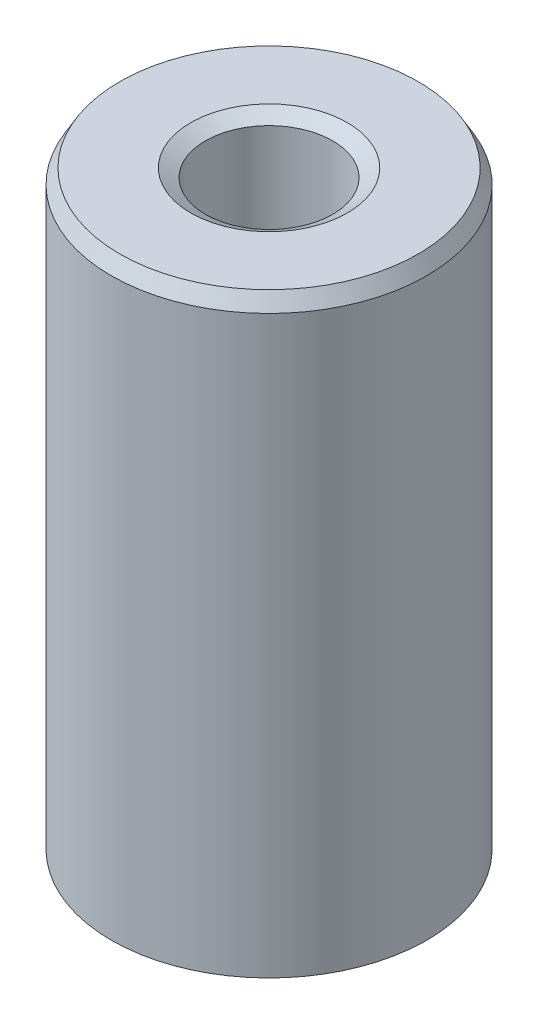
ISO-10303-21;
HEADER;
FILE_DESCRIPTION(('STEP AP214'),'2;1');
FILE_NAME('part.step','',(''),(''),'','','');
FILE_SCHEMA(('AUTOMOTIVE_DESIGN { 1 0 10303 214 1 1 1 1 }'));
ENDSEC;
DATA;
#1=APPLICATION_CONTEXT('core data for automotive mechanical design processes');
#2=APPLICATION_PROTOCOL_DEFINITION('international standard','automotive_design',2000,#1);
#3=PRODUCT_CONTEXT('',#1,'mechanical');
#4=PRODUCT('Part','Part','',(#3));
#5=PRODUCT_RELATED_PRODUCT_CATEGORY('part','',(#4));
#6=PRODUCT_DEFINITION_FORMATION('','',#4);
#7=PRODUCT_DEFINITION_CONTEXT('part definition',#1,'design');
#8=PRODUCT_DEFINITION('design','',#6,#7);
#9=PRODUCT_DEFINITION_SHAPE('','',#8);
#10=(LENGTH_UNIT() NAMED_UNIT(*) SI_UNIT(.MILLI.,.METRE.));
#11=(NAMED_UNIT(*) PLANE_ANGLE_UNIT() SI_UNIT($,.RADIAN.));
#12=(NAMED_UNIT(*) SI_UNIT($,.STERADIAN.) SOLID_ANGLE_UNIT());
#13=UNCERTAINTY_MEASURE_WITH_UNIT(LENGTH_MEASURE(1.E-05),#10,'distance_accuracy_value','');
#14=(GEOMETRIC_REPRESENTATION_CONTEXT(3) GLOBAL_UNCERTAINTY_ASSIGNED_CONTEXT((#13)) GLOBAL_UNIT_ASSIGNED_CONTEXT((#10,
#11,#12)) REPRESENTATION_CONTEXT('',''));
#15=CARTESIAN_POINT('',(0.,0.,0.));
#16=DIRECTION('',(0.,0.,1.));
#17=DIRECTION('',(1.,0.,0.));
#18=AXIS2_PLACEMENT_3D('',#15,#16,#17);
#19=CARTESIAN_POINT('',(0.,132.829947663581,0.));
#20=DIRECTION('',(0.,-1.,0.));
#21=DIRECTION('',(0.,0.,-1.));
#22=AXIS2_PLACEMENT_3D('',#19,#20,#21);
#23=CYLINDRICAL_SURFACE('',#22,35.);
#24=CARTESIAN_POINT('',(0.,1.87428707114171,0.));
#25=DIRECTION('',(0.,1.,0.));
#26=DIRECTION('',(0.,0.,1.));
#27=AXIS2_PLACEMENT_3D('',#24,#25,#26);
#28=CIRCLE('',#27,35.);
#29=CARTESIAN_POINT('',(0.,1.87428707114171,35.));
#30=VERTEX_POINT('',#29);
#31=EDGE_CURVE('E10',#30,#30,#28,.T.);
#32=ORIENTED_EDGE('',*,*,#31,.T.);
#33=EDGE_LOOP('',(#32));
#34=FACE_BOUND('',#33,.T.);
#35=CARTESIAN_POINT('',(0.,129.583587228394,0.));
#36=DIRECTION('',(0.,1.,0.));
#37=DIRECTION('',(0.,0.,1.));
#38=AXIS2_PLACEMENT_3D('',#35,#36,#37);
#39=CIRCLE('',#38,35.);
#40=CARTESIAN_POINT('',(0.,129.583587228394,35.));
#41=VERTEX_POINT('',#40);
#42=EDGE_CURVE('E50',#41,#41,#39,.F.);
#43=ORIENTED_EDGE('',*,*,#42,.T.);
#44=EDGE_LOOP('',(#43));
#45=FACE_BOUND('',#44,.T.);
#46=ADVANCED_FACE('F39',(#34,#45),#23,.T.);
#47=CARTESIAN_POINT('',(0.,132.829947663581,0.));
#48=DIRECTION('',(0.,1.,0.));
#49=DIRECTION('',(0.,0.,1.));
#50=AXIS2_PLACEMENT_3D('',#47,#48,#49);
#51=PLANE('',#50);
#52=CARTESIAN_POINT('',(0.,132.829947663581,0.));
#53=DIRECTION('',(0.,1.,0.));
#54=DIRECTION('',(0.,0.,1.));
#55=AXIS2_PLACEMENT_3D('',#52,#53,#54);
#56=CIRCLE('',#55,17.3772116874196);
#57=CARTESIAN_POINT('',(0.,132.829947663581,17.3772116874196));
#58=VERTEX_POINT('',#57);
#59=EDGE_CURVE('E58',#58,#58,#56,.F.);
#60=ORIENTED_EDGE('',*,*,#59,.T.);
#61=EDGE_LOOP('',(#60));
#62=FACE_BOUND('',#61,.T.);
#63=CARTESIAN_POINT('',(0.,132.829947663581,0.));
#64=DIRECTION('',(0.,1.,0.));
#65=DIRECTION('',(0.,0.,1.));
#66=AXIS2_PLACEMENT_3D('',#63,#64,#65);
#67=CIRCLE('',#66,33.1257129288583);
#68=CARTESIAN_POINT('',(0.,132.829947663581,33.1257129288583));
#69=VERTEX_POINT('',#68);
#70=EDGE_CURVE('E61',#69,#69,#67,.T.);
#71=ORIENTED_EDGE('',*,*,#70,.T.);
#72=EDGE_LOOP('',(#71));
#73=FACE_BOUND('',#72,.T.);
#74=ADVANCED_FACE('F88',(#62,#73),#51,.T.);
#75=CARTESIAN_POINT('',(0.,0.,0.));
#76=DIRECTION('',(0.,1.,0.));
#77=DIRECTION('',(0.,0.,1.));
#78=AXIS2_PLACEMENT_3D('',#75,#76,#77);
#79=PLANE('',#78);
#80=CARTESIAN_POINT('',(0.,0.,0.));
#81=DIRECTION('',(0.,1.,0.));
#82=DIRECTION('',(0.,0.,1.));
#83=AXIS2_PLACEMENT_3D('',#80,#81,#82);
#84=CIRCLE('',#83,16.0051383233744);
#85=CARTESIAN_POINT('',(0.,0.,16.0051383233744));
#86=VERTEX_POINT('',#85);
#87=EDGE_CURVE('E51',#86,#86,#84,.T.);
#88=ORIENTED_EDGE('',*,*,#87,.T.);
#89=EDGE_LOOP('',(#88));
#90=FACE_BOUND('',#89,.T.);
#91=CARTESIAN_POINT('',(0.,0.,0.));
#92=DIRECTION('',(0.,1.,0.));
#93=DIRECTION('',(0.,0.,1.));
#94=AXIS2_PLACEMENT_3D('',#91,#92,#93);
#95=CIRCLE('',#94,31.7536395648131);
#96=CARTESIAN_POINT('',(0.,0.,31.7536395648131));
#97=VERTEX_POINT('',#96);
#98=EDGE_CURVE('E54',#97,#97,#95,.F.);
#99=ORIENTED_EDGE('',*,*,#98,.T.);
#100=EDGE_LOOP('',(#99));
#101=FACE_BOUND('',#100,.T.);
#102=ADVANCED_FACE('F83',(#90,#101),#79,.F.);
#103=CARTESIAN_POINT('',(0.,132.829947663581,0.));
#104=DIRECTION('',(0.,-1.,0.));
#105=DIRECTION('',(0.,0.,-1.));
#106=AXIS2_PLACEMENT_3D('',#103,#104,#105);
#107=CYLINDRICAL_SURFACE('',#106,14.1308512522327);
#108=CARTESIAN_POINT('',(0.,130.955660592439,0.));
#109=DIRECTION('',(0.,1.,0.));
#110=DIRECTION('',(0.,0.,1.));
#111=AXIS2_PLACEMENT_3D('',#108,#109,#110);
#112=CIRCLE('',#111,14.1308512522327);
#113=CARTESIAN_POINT('',(0.,130.955660592439,14.1308512522326));
#114=VERTEX_POINT('',#113);
#115=EDGE_CURVE('E67',#114,#114,#112,.T.);
#116=ORIENTED_EDGE('',*,*,#115,.T.);
#117=EDGE_LOOP('',(#116));
#118=FACE_BOUND('',#117,.T.);
#119=CARTESIAN_POINT('',(0.,3.24636043518695,0.));
#120=DIRECTION('',(0.,1.,0.));
#121=DIRECTION('',(0.,0.,1.));
#122=AXIS2_PLACEMENT_3D('',#119,#120,#121);
#123=CIRCLE('',#122,14.1308512522327);
#124=CARTESIAN_POINT('',(0.,3.24636043518695,14.1308512522327));
#125=VERTEX_POINT('',#124);
#126=EDGE_CURVE('E69',#125,#125,#123,.F.);
#127=ORIENTED_EDGE('',*,*,#126,.T.);
#128=EDGE_LOOP('',(#127));
#129=FACE_BOUND('',#128,.T.);
#130=ADVANCED_FACE('F71',(#118,#129),#107,.F.);
#131=CARTESIAN_POINT('',(0.,130.955660592439,0.));
#132=DIRECTION('',(0.,1.,0.));
#133=DIRECTION('',(0.,0.,1.));
#134=AXIS2_PLACEMENT_3D('',#131,#132,#133);
#135=CONICAL_SURFACE('',#134,14.1308512522327,1.0471975511966);
#136=CARTESIAN_POINT('',(0.,132.829947663581,17.3772116874196));
#137=CARTESIAN_POINT('',(0.,132.810423839923,17.3433954328864));
#138=CARTESIAN_POINT('',(0.,132.790900016265,17.3095791783532));
#139=CARTESIAN_POINT('',(0.,132.75185236895,17.2419466692868));
#140=CARTESIAN_POINT('',(0.,132.732328545292,17.2081304147536));
#141=CARTESIAN_POINT('',(0.,132.693280897977,17.1404979056872));
#142=CARTESIAN_POINT('',(0.,132.673757074319,17.106681651154));
#143=CARTESIAN_POINT('',(0.,132.634709427004,17.0390491420876));
#144=CARTESIAN_POINT('',(0.,132.615185603346,17.0052328875544));
#145=CARTESIAN_POINT('',(0.,132.57613795603,16.937600378488));
#146=CARTESIAN_POINT('',(0.,132.556614132373,16.9037841239548));
#147=CARTESIAN_POINT('',(0.,132.517566485057,16.8361516148884));
#148=CARTESIAN_POINT('',(0.,132.498042661399,16.8023353603552));
#149=CARTESIAN_POINT('',(0.,132.458995014084,16.7347028512888));
#150=CARTESIAN_POINT('',(0.,132.439471190426,16.7008865967556));
#151=CARTESIAN_POINT('',(0.,132.400423543111,16.6332540876892));
#152=CARTESIAN_POINT('',(0.,132.380899719453,16.599437833156));
#153=CARTESIAN_POINT('',(0.,132.341852072138,16.5318053240896));
#154=CARTESIAN_POINT('',(0.,132.32232824848,16.4979890695564));
#155=CARTESIAN_POINT('',(0.,132.283280601165,16.4303565604901));
#156=CARTESIAN_POINT('',(0.,132.263756777507,16.3965403059569));
#157=CARTESIAN_POINT('',(0.,132.224709130191,16.3289077968905));
#158=CARTESIAN_POINT('',(0.,132.205185306534,16.2950915423573));
#159=CARTESIAN_POINT('',(0.,132.166137659218,16.2274590332909));
#160=CARTESIAN_POINT('',(0.,132.14661383556,16.1936427787577));
#161=CARTESIAN_POINT('',(0.,132.107566188245,16.1260102696913));
#162=CARTESIAN_POINT('',(0.,132.088042364587,16.0921940151581));
#163=CARTESIAN_POINT('',(0.,132.048994717272,16.0245615060917));
#164=CARTESIAN_POINT('',(0.,132.029470893614,15.9907452515585));
#165=CARTESIAN_POINT('',(0.,131.990423246299,15.9231127424921));
#166=CARTESIAN_POINT('',(0.,131.970899422641,15.8892964879589));
#167=CARTESIAN_POINT('',(0.,131.931851775325,15.8216639788925));
#168=CARTESIAN_POINT('',(0.,131.912327951668,15.7878477243593));
#169=CARTESIAN_POINT('',(0.,131.873280304352,15.7202152152929));
#170=CARTESIAN_POINT('',(0.,131.853756480695,15.6863989607597));
#171=CARTESIAN_POINT('',(0.,131.814708833379,15.6187664516933));
#172=CARTESIAN_POINT('',(0.,131.795185009721,15.5849501971601));
#173=CARTESIAN_POINT('',(0.,131.756137362406,15.5173176880937));
#174=CARTESIAN_POINT('',(0.,131.736613538748,15.4835014335605));
#175=CARTESIAN_POINT('',(0.,131.697565891433,15.4158689244941));
#176=CARTESIAN_POINT('',(0.,131.678042067775,15.3820526699609));
#177=CARTESIAN_POINT('',(0.,131.63899442046,15.3144201608945));
#178=CARTESIAN_POINT('',(0.,131.619470596802,15.2806039063613));
#179=CARTESIAN_POINT('',(0.,131.580422949486,15.212971397295));
#180=CARTESIAN_POINT('',(0.,131.560899125829,15.1791551427618));
#181=CARTESIAN_POINT('',(0.,131.521851478513,15.1115226336954));
#182=CARTESIAN_POINT('',(0.,131.502327654855,15.0777063791622));
#183=CARTESIAN_POINT('',(0.,131.46328000754,15.0100738700958));
#184=CARTESIAN_POINT('',(0.,131.443756183882,14.9762576155626));
#185=CARTESIAN_POINT('',(0.,131.404708536567,14.9086251064962));
#186=CARTESIAN_POINT('',(0.,131.385184712909,14.874808851963));
#187=CARTESIAN_POINT('',(0.,131.346137065594,14.8071763428966));
#188=CARTESIAN_POINT('',(0.,131.326613241936,14.7733600883634));
#189=CARTESIAN_POINT('',(0.,131.28756559462,14.705727579297));
#190=CARTESIAN_POINT('',(0.,131.268041770963,14.6719113247638));
#191=CARTESIAN_POINT('',(0.,131.228994123647,14.6042788156974));
#192=CARTESIAN_POINT('',(0.,131.20947029999,14.5704625611642));
#193=CARTESIAN_POINT('',(0.,131.170422652674,14.5028300520978));
#194=CARTESIAN_POINT('',(0.,131.150898829016,14.4690137975646));
#195=CARTESIAN_POINT('',(0.,131.111851181701,14.4013812884982));
#196=CARTESIAN_POINT('',(0.,131.092327358043,14.367565033965));
#197=CARTESIAN_POINT('',(0.,131.053279710728,14.2999325248986));
#198=CARTESIAN_POINT('',(0.,131.03375588707,14.2661162703654));
#199=CARTESIAN_POINT('',(0.,130.994708239755,14.198483761299));
#200=CARTESIAN_POINT('',(0.,130.975184416097,14.1646675067658));
#201=CARTESIAN_POINT('',(0.,130.955660592439,14.1308512522326));
#202=B_SPLINE_CURVE_WITH_KNOTS('',3,(#136,#137,#138,#139,#140,#141,#142,#143,#144,#145,#146,
#147,#148,#149,#150,#151,#152,#153,#154,#155,#156,#157,#158,#159,#160,#161,#162,#163,#164,#165,
#166,#167,#168,#169,#170,#171,#172,#173,#174,#175,#176,#177,#178,#179,#180,#181,#182,#183,#184,
#185,#186,#187,#188,#189,#190,#191,#192,#193,#194,#195,#196,#197,#198,#199,#200,#201),
.UNSPECIFIED.,.F.,.F.,(4,2,2,2,2,2,2,2,2,2,2,2,2,2,2,2,2,2,2,2,2,2,2,2,2,2,2,2,2,2,2,2,4),(0.,
0.117142941946346,0.234285883892708,0.351428825839067,0.468571767785427,0.585714709731789,
0.702857651678135,0.820000593624497,0.937143535570857,1.05428647751722,1.17142941946358,
1.28857236140992,1.40571530335628,1.52285824530265,1.64000118724901,1.75714412919537,
1.87428707114173,1.99143001308807,2.10857295503443,2.2257158969808,2.34285883892716,
2.46000178087352,2.57714472281986,2.69428766476622,2.81143060671258,2.92857354865895,
3.04571649060531,3.16285943255165,3.28000237449801,3.39714531644437,3.51428825839073,
3.63143120033709,3.74857414228344),.UNSPECIFIED.);
#203=EDGE_CURVE('BSEAM77',#58,#114,#202,.T.);
#204=ORIENTED_EDGE('',*,*,#59,.F.);
#205=ORIENTED_EDGE('',*,*,#115,.F.);
#206=ORIENTED_EDGE('',*,*,#203,.T.);
#207=ORIENTED_EDGE('',*,*,#203,.F.);
#208=EDGE_LOOP('',(#204,#206,#205,#207));
#209=FACE_BOUND('',#208,.T.);
#210=ADVANCED_FACE('F77',(#209),#135,.F.);
#211=CARTESIAN_POINT('',(0.,0.,0.));
#212=DIRECTION('',(0.,-1.,0.));
#213=DIRECTION('',(0.,0.,-1.));
#214=AXIS2_PLACEMENT_3D('',#211,#212,#213);
#215=CONICAL_SURFACE('',#214,16.0051383233744,0.523598775598292);
#216=ORIENTED_EDGE('',*,*,#126,.F.);
#217=EDGE_LOOP('',(#216));
#218=FACE_BOUND('',#217,.T.);
#219=ORIENTED_EDGE('',*,*,#87,.F.);
#220=EDGE_LOOP('',(#219));
#221=FACE_BOUND('',#220,.T.);
#222=ADVANCED_FACE('F73',(#218,#221),#215,.F.);
#223=CARTESIAN_POINT('',(0.,1.87428707114171,0.));
#224=DIRECTION('',(0.,1.,0.));
#225=DIRECTION('',(0.,0.,1.));
#226=AXIS2_PLACEMENT_3D('',#223,#224,#225);
#227=CONICAL_SURFACE('',#226,35.,1.04719755119661);
#228=ORIENTED_EDGE('',*,*,#98,.F.);
#229=EDGE_LOOP('',(#228));
#230=FACE_BOUND('',#229,.T.);
#231=ORIENTED_EDGE('',*,*,#31,.F.);
#232=EDGE_LOOP('',(#231));
#233=FACE_BOUND('',#232,.T.);
#234=ADVANCED_FACE('F76',(#230,#233),#227,.T.);
#235=CARTESIAN_POINT('',(0.,132.829947663581,0.));
#236=DIRECTION('',(0.,-1.,0.));
#237=DIRECTION('',(0.,0.,-1.));
#238=AXIS2_PLACEMENT_3D('',#235,#236,#237);
#239=CONICAL_SURFACE('',#238,33.1257129288583,0.523598775598296);
#240=ORIENTED_EDGE('',*,*,#42,.F.);
#241=EDGE_LOOP('',(#240));
#242=FACE_BOUND('',#241,.T.);
#243=ORIENTED_EDGE('',*,*,#70,.F.);
#244=EDGE_LOOP('',(#243));
#245=FACE_BOUND('',#244,.T.);
#246=ADVANCED_FACE('F45',(#242,#245),#239,.T.);
#247=CLOSED_SHELL('',(#46,#74,#102,#130,#210,#222,#234,#246));
#248=MANIFOLD_SOLID_BREP('B2',#247);
#249=ADVANCED_BREP_SHAPE_REPRESENTATION('',(#18,#248),#14);
#250=SHAPE_DEFINITION_REPRESENTATION(#9,#249);
ENDSEC;
END-ISO-10303-21;
